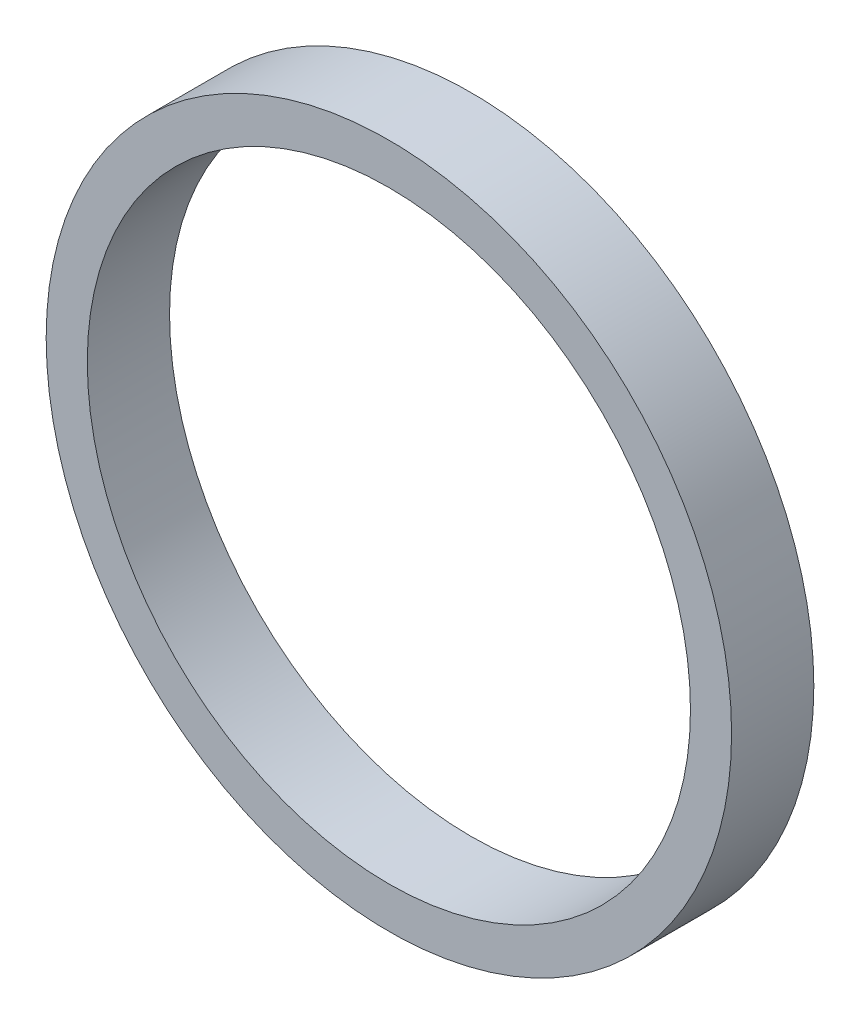
ISO-10303-21;
HEADER;
FILE_DESCRIPTION(('STEP AP214'),'2;1');
FILE_NAME('part.step','',(''),(''),'','','');
FILE_SCHEMA(('AUTOMOTIVE_DESIGN { 1 0 10303 214 1 1 1 1 }'));
ENDSEC;
DATA;
#1=APPLICATION_CONTEXT('core data for automotive mechanical design processes');
#2=APPLICATION_PROTOCOL_DEFINITION('international standard','automotive_design',2000,#1);
#3=PRODUCT_CONTEXT('',#1,'mechanical');
#4=PRODUCT('Part','Part','',(#3));
#5=PRODUCT_RELATED_PRODUCT_CATEGORY('part','',(#4));
#6=PRODUCT_DEFINITION_FORMATION('','',#4);
#7=PRODUCT_DEFINITION_CONTEXT('part definition',#1,'design');
#8=PRODUCT_DEFINITION('design','',#6,#7);
#9=PRODUCT_DEFINITION_SHAPE('','',#8);
#10=(LENGTH_UNIT() NAMED_UNIT(*) SI_UNIT(.MILLI.,.METRE.));
#11=(NAMED_UNIT(*) PLANE_ANGLE_UNIT() SI_UNIT($,.RADIAN.));
#12=(NAMED_UNIT(*) SI_UNIT($,.STERADIAN.) SOLID_ANGLE_UNIT());
#13=UNCERTAINTY_MEASURE_WITH_UNIT(LENGTH_MEASURE(1.E-05),#10,'distance_accuracy_value','');
#14=(GEOMETRIC_REPRESENTATION_CONTEXT(3) GLOBAL_UNCERTAINTY_ASSIGNED_CONTEXT((#13)) GLOBAL_UNIT_ASSIGNED_CONTEXT((#10,
#11,#12)) REPRESENTATION_CONTEXT('',''));
#15=CARTESIAN_POINT('',(0.,0.,0.));
#16=DIRECTION('',(0.,0.,1.));
#17=DIRECTION('',(1.,0.,0.));
#18=AXIS2_PLACEMENT_3D('',#15,#16,#17);
#19=CARTESIAN_POINT('',(0.,0.,1.5));
#20=DIRECTION('',(0.,0.,1.));
#21=DIRECTION('',(1.,0.,0.));
#22=AXIS2_PLACEMENT_3D('',#19,#20,#21);
#23=PLANE('',#22);
#24=CARTESIAN_POINT('',(0.,0.,1.5));
#25=DIRECTION('',(0.,0.,1.));
#26=DIRECTION('',(1.,0.,0.));
#27=AXIS2_PLACEMENT_3D('',#24,#25,#26);
#28=CIRCLE('',#27,6.25);
#29=CARTESIAN_POINT('',(6.25,0.,1.5));
#30=VERTEX_POINT('',#29);
#31=EDGE_CURVE('E10',#30,#30,#28,.T.);
#32=ORIENTED_EDGE('',*,*,#31,.T.);
#33=EDGE_LOOP('',(#32));
#34=FACE_BOUND('',#33,.T.);
#35=CARTESIAN_POINT('',(0.,0.,1.5));
#36=DIRECTION('',(0.,0.,1.));
#37=DIRECTION('',(1.,0.,0.));
#38=AXIS2_PLACEMENT_3D('',#35,#36,#37);
#39=CIRCLE('',#38,5.5);
#40=CARTESIAN_POINT('',(5.5,0.,1.5));
#41=VERTEX_POINT('',#40);
#42=EDGE_CURVE('E42',#41,#41,#39,.T.);
#43=ORIENTED_EDGE('',*,*,#42,.F.);
#44=EDGE_LOOP('',(#43));
#45=FACE_BOUND('',#44,.T.);
#46=ADVANCED_FACE('F31',(#34,#45),#23,.T.);
#47=CARTESIAN_POINT('',(0.,0.,0.));
#48=DIRECTION('',(0.,0.,1.));
#49=DIRECTION('',(1.,0.,0.));
#50=AXIS2_PLACEMENT_3D('',#47,#48,#49);
#51=PLANE('',#50);
#52=CARTESIAN_POINT('',(0.,0.,0.));
#53=DIRECTION('',(0.,0.,1.));
#54=DIRECTION('',(1.,0.,0.));
#55=AXIS2_PLACEMENT_3D('',#52,#53,#54);
#56=CIRCLE('',#55,6.25);
#57=CARTESIAN_POINT('',(6.25,0.,0.));
#58=VERTEX_POINT('',#57);
#59=EDGE_CURVE('E35',#58,#58,#56,.T.);
#60=ORIENTED_EDGE('',*,*,#59,.F.);
#61=EDGE_LOOP('',(#60));
#62=FACE_BOUND('',#61,.T.);
#63=CARTESIAN_POINT('',(0.,0.,0.));
#64=DIRECTION('',(0.,0.,1.));
#65=DIRECTION('',(1.,0.,0.));
#66=AXIS2_PLACEMENT_3D('',#63,#64,#65);
#67=CIRCLE('',#66,5.5);
#68=CARTESIAN_POINT('',(5.5,0.,0.));
#69=VERTEX_POINT('',#68);
#70=EDGE_CURVE('E44',#69,#69,#67,.T.);
#71=ORIENTED_EDGE('',*,*,#70,.T.);
#72=EDGE_LOOP('',(#71));
#73=FACE_BOUND('',#72,.T.);
#74=ADVANCED_FACE('F54',(#62,#73),#51,.F.);
#75=CARTESIAN_POINT('',(0.,0.,1.5));
#76=DIRECTION('',(0.,0.,-1.));
#77=DIRECTION('',(-1.,0.,0.));
#78=AXIS2_PLACEMENT_3D('',#75,#76,#77);
#79=CYLINDRICAL_SURFACE('',#78,6.25);
#80=ORIENTED_EDGE('',*,*,#31,.F.);
#81=EDGE_LOOP('',(#80));
#82=FACE_BOUND('',#81,.T.);
#83=ORIENTED_EDGE('',*,*,#59,.T.);
#84=EDGE_LOOP('',(#83));
#85=FACE_BOUND('',#84,.T.);
#86=ADVANCED_FACE('F33',(#82,#85),#79,.T.);
#87=CARTESIAN_POINT('',(0.,0.,1.5));
#88=DIRECTION('',(0.,0.,-1.));
#89=DIRECTION('',(-1.,0.,0.));
#90=AXIS2_PLACEMENT_3D('',#87,#88,#89);
#91=CYLINDRICAL_SURFACE('',#90,5.5);
#92=ORIENTED_EDGE('',*,*,#42,.T.);
#93=EDGE_LOOP('',(#92));
#94=FACE_BOUND('',#93,.T.);
#95=ORIENTED_EDGE('',*,*,#70,.F.);
#96=EDGE_LOOP('',(#95));
#97=FACE_BOUND('',#96,.T.);
#98=ADVANCED_FACE('F50',(#94,#97),#91,.F.);
#99=CLOSED_SHELL('',(#46,#74,#86,#98));
#100=MANIFOLD_SOLID_BREP('B2',#99);
#101=ADVANCED_BREP_SHAPE_REPRESENTATION('',(#18,#100),#14);
#102=SHAPE_DEFINITION_REPRESENTATION(#9,#101);
ENDSEC;
END-ISO-10303-21;
